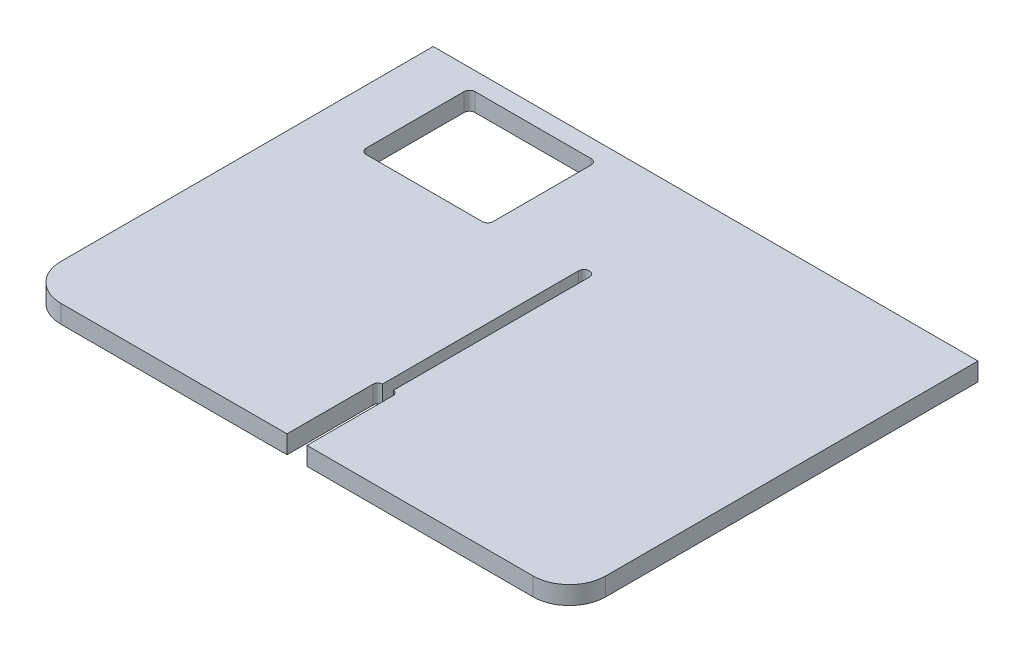
ISO-10303-21;
HEADER;
FILE_DESCRIPTION(('STEP AP214'),'2;1');
FILE_NAME('part.step','',(''),(''),'','','');
FILE_SCHEMA(('AUTOMOTIVE_DESIGN { 1 0 10303 214 1 1 1 1 }'));
ENDSEC;
DATA;
#1=APPLICATION_CONTEXT('core data for automotive mechanical design processes');
#2=APPLICATION_PROTOCOL_DEFINITION('international standard','automotive_design',2000,#1);
#3=PRODUCT_CONTEXT('',#1,'mechanical');
#4=PRODUCT('Part','Part','',(#3));
#5=PRODUCT_RELATED_PRODUCT_CATEGORY('part','',(#4));
#6=PRODUCT_DEFINITION_FORMATION('','',#4);
#7=PRODUCT_DEFINITION_CONTEXT('part definition',#1,'design');
#8=PRODUCT_DEFINITION('design','',#6,#7);
#9=PRODUCT_DEFINITION_SHAPE('','',#8);
#10=(LENGTH_UNIT() NAMED_UNIT(*) SI_UNIT(.MILLI.,.METRE.));
#11=(NAMED_UNIT(*) PLANE_ANGLE_UNIT() SI_UNIT($,.RADIAN.));
#12=(NAMED_UNIT(*) SI_UNIT($,.STERADIAN.) SOLID_ANGLE_UNIT());
#13=UNCERTAINTY_MEASURE_WITH_UNIT(LENGTH_MEASURE(1.E-05),#10,'distance_accuracy_value','');
#14=(GEOMETRIC_REPRESENTATION_CONTEXT(3) GLOBAL_UNCERTAINTY_ASSIGNED_CONTEXT((#13)) GLOBAL_UNIT_ASSIGNED_CONTEXT((#10,
#11,#12)) REPRESENTATION_CONTEXT('',''));
#15=CARTESIAN_POINT('',(0.,0.,0.));
#16=DIRECTION('',(0.,0.,1.));
#17=DIRECTION('',(1.,0.,0.));
#18=AXIS2_PLACEMENT_3D('',#15,#16,#17);
#19=CARTESIAN_POINT('',(0.,10.,75.));
#20=DIRECTION('',(0.,0.,-1.));
#21=DIRECTION('',(-1.,0.,0.));
#22=AXIS2_PLACEMENT_3D('',#19,#20,#21);
#23=PLANE('',#22);
#24=DIRECTION('',(1.,0.,0.));
#25=VECTOR('',#24,1.);
#26=CARTESIAN_POINT('',(0.,0.,75.));
#27=LINE('',#26,#25);
#28=CARTESIAN_POINT('',(-130.,0.,75.));
#29=VERTEX_POINT('',#28);
#30=CARTESIAN_POINT('',(-5.52414962358277,0.,75.));
#31=VERTEX_POINT('',#30);
#32=EDGE_CURVE('E287',#29,#31,#27,.T.);
#33=ORIENTED_EDGE('',*,*,#32,.T.);
#34=DIRECTION('',(0.,-1.,0.));
#35=VECTOR('',#34,1.);
#36=CARTESIAN_POINT('',(-5.52414962358277,10.,75.));
#37=LINE('',#36,#35);
#38=CARTESIAN_POINT('',(-5.52414962358277,10.,75.));
#39=VERTEX_POINT('',#38);
#40=EDGE_CURVE('E237',#39,#31,#37,.T.);
#41=ORIENTED_EDGE('',*,*,#40,.F.);
#42=DIRECTION('',(1.,0.,0.));
#43=VECTOR('',#42,1.);
#44=CARTESIAN_POINT('',(0.,10.,75.));
#45=LINE('',#44,#43);
#46=CARTESIAN_POINT('',(-130.,10.,75.));
#47=VERTEX_POINT('',#46);
#48=EDGE_CURVE('E278',#47,#39,#45,.T.);
#49=ORIENTED_EDGE('',*,*,#48,.F.);
#50=DIRECTION('',(0.,-1.,0.));
#51=VECTOR('',#50,1.);
#52=CARTESIAN_POINT('',(-130.,0.,75.));
#53=LINE('',#52,#51);
#54=EDGE_CURVE('E308',#47,#29,#53,.T.);
#55=ORIENTED_EDGE('',*,*,#54,.T.);
#56=EDGE_LOOP('',(#33,#41,#49,#55));
#57=FACE_BOUND('',#56,.T.);
#58=ADVANCED_FACE('F31',(#57),#23,.F.);
#59=CARTESIAN_POINT('',(0.,10.,-150.));
#60=DIRECTION('',(0.,1.,0.));
#61=DIRECTION('',(0.,0.,1.));
#62=AXIS2_PLACEMENT_3D('',#59,#60,#61);
#63=PLANE('',#62);
#64=DIRECTION('',(0.,0.,-1.));
#65=VECTOR('',#64,1.);
#66=CARTESIAN_POINT('',(-5.52414962358277,10.,27.5241496235828));
#67=LINE('',#66,#65);
#68=CARTESIAN_POINT('',(-5.52414962358277,10.,27.5241496235828));
#69=VERTEX_POINT('',#68);
#70=EDGE_CURVE('E193',#39,#69,#67,.T.);
#71=ORIENTED_EDGE('',*,*,#70,.T.);
#72=CARTESIAN_POINT('',(-2.99999999999999,10.,27.5241496235828));
#73=DIRECTION('',(0.,-1.,0.));
#74=DIRECTION('',(0.,0.,1.));
#75=AXIS2_PLACEMENT_3D('',#72,#73,#74);
#76=CIRCLE('',#75,2.52414962358278);
#77=CARTESIAN_POINT('',(-3.00000000000001,10.,25.));
#78=VERTEX_POINT('',#77);
#79=EDGE_CURVE('E185',#69,#78,#76,.T.);
#80=ORIENTED_EDGE('',*,*,#79,.T.);
#81=DIRECTION('',(0.,0.,-1.));
#82=VECTOR('',#81,1.);
#83=CARTESIAN_POINT('',(-3.00000000000001,10.,25.));
#84=LINE('',#83,#82);
#85=CARTESIAN_POINT('',(-2.99999999999999,10.,-83.));
#86=VERTEX_POINT('',#85);
#87=EDGE_CURVE('E196',#78,#86,#84,.T.);
#88=ORIENTED_EDGE('',*,*,#87,.T.);
#89=CARTESIAN_POINT('',(0.,10.,-83.));
#90=DIRECTION('',(0.,-1.,0.));
#91=DIRECTION('',(0.,0.,-1.));
#92=AXIS2_PLACEMENT_3D('',#89,#90,#91);
#93=CIRCLE('',#92,3.);
#94=CARTESIAN_POINT('',(3.00000000000001,10.,-83.));
#95=VERTEX_POINT('',#94);
#96=EDGE_CURVE('E201',#86,#95,#93,.T.);
#97=ORIENTED_EDGE('',*,*,#96,.T.);
#98=DIRECTION('',(0.,0.,1.));
#99=VECTOR('',#98,1.);
#100=CARTESIAN_POINT('',(2.99999999999999,10.,25.));
#101=LINE('',#100,#99);
#102=CARTESIAN_POINT('',(2.99999999999999,10.,25.));
#103=VERTEX_POINT('',#102);
#104=EDGE_CURVE('E211',#95,#103,#101,.T.);
#105=ORIENTED_EDGE('',*,*,#104,.T.);
#106=CARTESIAN_POINT('',(3.00000000000002,10.,27.4758503764172));
#107=DIRECTION('',(0.,-1.,0.));
#108=DIRECTION('',(0.,0.,1.));
#109=AXIS2_PLACEMENT_3D('',#106,#107,#108);
#110=CIRCLE('',#109,2.4758503764172);
#111=CARTESIAN_POINT('',(5.47585037641722,10.,27.4758503764172));
#112=VERTEX_POINT('',#111);
#113=EDGE_CURVE('E214',#103,#112,#110,.T.);
#114=ORIENTED_EDGE('',*,*,#113,.T.);
#115=DIRECTION('',(0.,0.,1.));
#116=VECTOR('',#115,1.);
#117=CARTESIAN_POINT('',(5.47585037641722,10.,27.4758503764172));
#118=LINE('',#117,#116);
#119=CARTESIAN_POINT('',(5.47585037641721,10.,75.));
#120=VERTEX_POINT('',#119);
#121=EDGE_CURVE('E217',#112,#120,#118,.T.);
#122=ORIENTED_EDGE('',*,*,#121,.T.);
#123=CARTESIAN_POINT('',(130.,10.,75.));
#124=VERTEX_POINT('',#123);
#125=EDGE_CURVE('E281',#120,#124,#45,.T.);
#126=ORIENTED_EDGE('',*,*,#125,.T.);
#127=CARTESIAN_POINT('',(130.,10.,55.));
#128=DIRECTION('',(0.,1.,0.));
#129=DIRECTION('',(0.,0.,1.));
#130=AXIS2_PLACEMENT_3D('',#127,#128,#129);
#131=CIRCLE('',#130,20.);
#132=CARTESIAN_POINT('',(150.,10.,55.));
#133=VERTEX_POINT('',#132);
#134=EDGE_CURVE('E306',#124,#133,#131,.T.);
#135=ORIENTED_EDGE('',*,*,#134,.T.);
#136=DIRECTION('',(0.,0.,-1.));
#137=VECTOR('',#136,1.);
#138=CARTESIAN_POINT('',(150.,10.,75.));
#139=LINE('',#138,#137);
#140=CARTESIAN_POINT('',(150.,10.,-150.));
#141=VERTEX_POINT('',#140);
#142=EDGE_CURVE('E280',#133,#141,#139,.T.);
#143=ORIENTED_EDGE('',*,*,#142,.T.);
#144=DIRECTION('',(-1.,0.,0.));
#145=VECTOR('',#144,1.);
#146=CARTESIAN_POINT('',(150.,10.,-150.));
#147=LINE('',#146,#145);
#148=CARTESIAN_POINT('',(-150.,10.,-150.));
#149=VERTEX_POINT('',#148);
#150=EDGE_CURVE('E283',#141,#149,#147,.T.);
#151=ORIENTED_EDGE('',*,*,#150,.T.);
#152=DIRECTION('',(0.,0.,-1.));
#153=VECTOR('',#152,1.);
#154=CARTESIAN_POINT('',(-150.,10.,-75.));
#155=LINE('',#154,#153);
#156=CARTESIAN_POINT('',(-150.,10.,55.));
#157=VERTEX_POINT('',#156);
#158=EDGE_CURVE('E271',#157,#149,#155,.T.);
#159=ORIENTED_EDGE('',*,*,#158,.F.);
#160=CARTESIAN_POINT('',(-130.,10.,55.));
#161=DIRECTION('',(0.,1.,0.));
#162=DIRECTION('',(0.,0.,1.));
#163=AXIS2_PLACEMENT_3D('',#160,#161,#162);
#164=CIRCLE('',#163,20.);
#165=EDGE_CURVE('E315',#157,#47,#164,.T.);
#166=ORIENTED_EDGE('',*,*,#165,.T.);
#167=ORIENTED_EDGE('',*,*,#48,.T.);
#168=EDGE_LOOP('',(#71,#80,#88,#97,#105,#114,#122,#126,#135,#143,#151,#159,#166,#167));
#169=FACE_BOUND('',#168,.T.);
#170=DIRECTION('',(1.,0.,0.));
#171=VECTOR('',#170,1.);
#172=CARTESIAN_POINT('',(-120.,10.,-80.));
#173=LINE('',#172,#171);
#174=CARTESIAN_POINT('',(-117.,10.,-80.));
#175=VERTEX_POINT('',#174);
#176=CARTESIAN_POINT('',(-53.,10.,-80.));
#177=VERTEX_POINT('',#176);
#178=EDGE_CURVE('E251',#175,#177,#173,.T.);
#179=ORIENTED_EDGE('',*,*,#178,.F.);
#180=CARTESIAN_POINT('',(-117.,10.,-83.));
#181=DIRECTION('',(0.,1.,0.));
#182=DIRECTION('',(0.,0.,1.));
#183=AXIS2_PLACEMENT_3D('',#180,#181,#182);
#184=CIRCLE('',#183,3.);
#185=CARTESIAN_POINT('',(-120.,10.,-83.));
#186=VERTEX_POINT('',#185);
#187=EDGE_CURVE('E339',#175,#186,#184,.F.);
#188=ORIENTED_EDGE('',*,*,#187,.T.);
#189=DIRECTION('',(0.,0.,1.));
#190=VECTOR('',#189,1.);
#191=CARTESIAN_POINT('',(-120.,10.,-140.));
#192=LINE('',#191,#190);
#193=CARTESIAN_POINT('',(-120.,10.,-137.));
#194=VERTEX_POINT('',#193);
#195=EDGE_CURVE('E248',#194,#186,#192,.T.);
#196=ORIENTED_EDGE('',*,*,#195,.F.);
#197=CARTESIAN_POINT('',(-117.,10.,-137.));
#198=DIRECTION('',(0.,1.,0.));
#199=DIRECTION('',(0.,0.,1.));
#200=AXIS2_PLACEMENT_3D('',#197,#198,#199);
#201=CIRCLE('',#200,3.);
#202=CARTESIAN_POINT('',(-117.,10.,-140.));
#203=VERTEX_POINT('',#202);
#204=EDGE_CURVE('E54',#194,#203,#201,.F.);
#205=ORIENTED_EDGE('',*,*,#204,.T.);
#206=DIRECTION('',(-1.,0.,0.));
#207=VECTOR('',#206,1.);
#208=CARTESIAN_POINT('',(-120.,10.,-140.));
#209=LINE('',#208,#207);
#210=CARTESIAN_POINT('',(-53.,10.,-140.));
#211=VERTEX_POINT('',#210);
#212=EDGE_CURVE('E258',#211,#203,#209,.T.);
#213=ORIENTED_EDGE('',*,*,#212,.F.);
#214=CARTESIAN_POINT('',(-53.,10.,-137.));
#215=DIRECTION('',(0.,1.,0.));
#216=DIRECTION('',(0.,0.,1.));
#217=AXIS2_PLACEMENT_3D('',#214,#215,#216);
#218=CIRCLE('',#217,3.);
#219=CARTESIAN_POINT('',(-50.,10.,-137.));
#220=VERTEX_POINT('',#219);
#221=EDGE_CURVE('E11',#211,#220,#218,.F.);
#222=ORIENTED_EDGE('',*,*,#221,.T.);
#223=DIRECTION('',(0.,0.,-1.));
#224=VECTOR('',#223,1.);
#225=CARTESIAN_POINT('',(-50.,10.,-140.));
#226=LINE('',#225,#224);
#227=CARTESIAN_POINT('',(-50.,10.,-83.));
#228=VERTEX_POINT('',#227);
#229=EDGE_CURVE('E255',#228,#220,#226,.T.);
#230=ORIENTED_EDGE('',*,*,#229,.F.);
#231=CARTESIAN_POINT('',(-53.,10.,-83.));
#232=DIRECTION('',(0.,1.,0.));
#233=DIRECTION('',(0.,0.,1.));
#234=AXIS2_PLACEMENT_3D('',#231,#232,#233);
#235=CIRCLE('',#234,3.);
#236=EDGE_CURVE('E343',#228,#177,#235,.F.);
#237=ORIENTED_EDGE('',*,*,#236,.T.);
#238=EDGE_LOOP('',(#179,#188,#196,#205,#213,#222,#230,#237));
#239=FACE_BOUND('',#238,.T.);
#240=ADVANCED_FACE('F203',(#169,#239),#63,.T.);
#241=CARTESIAN_POINT('',(0.,0.,-150.));
#242=DIRECTION('',(0.,1.,0.));
#243=DIRECTION('',(0.,0.,1.));
#244=AXIS2_PLACEMENT_3D('',#241,#242,#243);
#245=PLANE('',#244);
#246=CARTESIAN_POINT('',(-2.99999999999999,0.,27.5241496235828));
#247=DIRECTION('',(0.,-1.,0.));
#248=DIRECTION('',(0.,0.,1.));
#249=AXIS2_PLACEMENT_3D('',#246,#247,#248);
#250=CIRCLE('',#249,2.52414962358278);
#251=CARTESIAN_POINT('',(-5.52414962358277,0.,27.5241496235828));
#252=VERTEX_POINT('',#251);
#253=CARTESIAN_POINT('',(-3.00000000000001,0.,25.));
#254=VERTEX_POINT('',#253);
#255=EDGE_CURVE('E188',#252,#254,#250,.T.);
#256=ORIENTED_EDGE('',*,*,#255,.F.);
#257=DIRECTION('',(0.,0.,-1.));
#258=VECTOR('',#257,1.);
#259=CARTESIAN_POINT('',(-5.52414962358277,0.,27.5241496235828));
#260=LINE('',#259,#258);
#261=EDGE_CURVE('E205',#31,#252,#260,.T.);
#262=ORIENTED_EDGE('',*,*,#261,.F.);
#263=ORIENTED_EDGE('',*,*,#32,.F.);
#264=CARTESIAN_POINT('',(-130.,0.,55.));
#265=DIRECTION('',(0.,1.,0.));
#266=DIRECTION('',(0.,0.,1.));
#267=AXIS2_PLACEMENT_3D('',#264,#265,#266);
#268=CIRCLE('',#267,20.);
#269=CARTESIAN_POINT('',(-150.,0.,55.));
#270=VERTEX_POINT('',#269);
#271=EDGE_CURVE('E311',#29,#270,#268,.F.);
#272=ORIENTED_EDGE('',*,*,#271,.T.);
#273=DIRECTION('',(0.,0.,-1.));
#274=VECTOR('',#273,1.);
#275=CARTESIAN_POINT('',(-150.,0.,75.));
#276=LINE('',#275,#274);
#277=CARTESIAN_POINT('',(-150.,0.,-150.));
#278=VERTEX_POINT('',#277);
#279=EDGE_CURVE('E260',#270,#278,#276,.T.);
#280=ORIENTED_EDGE('',*,*,#279,.T.);
#281=DIRECTION('',(-1.,0.,0.));
#282=VECTOR('',#281,1.);
#283=CARTESIAN_POINT('',(150.,0.,-150.));
#284=LINE('',#283,#282);
#285=CARTESIAN_POINT('',(150.,0.,-150.));
#286=VERTEX_POINT('',#285);
#287=EDGE_CURVE('E292',#286,#278,#284,.T.);
#288=ORIENTED_EDGE('',*,*,#287,.F.);
#289=DIRECTION('',(0.,0.,-1.));
#290=VECTOR('',#289,1.);
#291=CARTESIAN_POINT('',(150.,0.,-75.));
#292=LINE('',#291,#290);
#293=CARTESIAN_POINT('',(150.,0.,55.));
#294=VERTEX_POINT('',#293);
#295=EDGE_CURVE('E290',#294,#286,#292,.T.);
#296=ORIENTED_EDGE('',*,*,#295,.F.);
#297=CARTESIAN_POINT('',(130.,0.,55.));
#298=DIRECTION('',(0.,1.,0.));
#299=DIRECTION('',(0.,0.,1.));
#300=AXIS2_PLACEMENT_3D('',#297,#298,#299);
#301=CIRCLE('',#300,20.);
#302=CARTESIAN_POINT('',(130.,0.,75.));
#303=VERTEX_POINT('',#302);
#304=EDGE_CURVE('E300',#294,#303,#301,.F.);
#305=ORIENTED_EDGE('',*,*,#304,.T.);
#306=CARTESIAN_POINT('',(5.47585037641722,0.,75.));
#307=VERTEX_POINT('',#306);
#308=EDGE_CURVE('E277',#307,#303,#27,.T.);
#309=ORIENTED_EDGE('',*,*,#308,.F.);
#310=DIRECTION('',(0.,0.,1.));
#311=VECTOR('',#310,1.);
#312=CARTESIAN_POINT('',(5.47585037641722,0.,27.4758503764172));
#313=LINE('',#312,#311);
#314=CARTESIAN_POINT('',(5.47585037641722,0.,27.4758503764172));
#315=VERTEX_POINT('',#314);
#316=EDGE_CURVE('E46',#315,#307,#313,.T.);
#317=ORIENTED_EDGE('',*,*,#316,.F.);
#318=CARTESIAN_POINT('',(3.00000000000002,0.,27.4758503764172));
#319=DIRECTION('',(0.,-1.,0.));
#320=DIRECTION('',(0.,0.,1.));
#321=AXIS2_PLACEMENT_3D('',#318,#319,#320);
#322=CIRCLE('',#321,2.4758503764172);
#323=CARTESIAN_POINT('',(2.99999999999999,0.,25.));
#324=VERTEX_POINT('',#323);
#325=EDGE_CURVE('E230',#324,#315,#322,.T.);
#326=ORIENTED_EDGE('',*,*,#325,.F.);
#327=DIRECTION('',(0.,0.,1.));
#328=VECTOR('',#327,1.);
#329=CARTESIAN_POINT('',(2.99999999999999,0.,25.));
#330=LINE('',#329,#328);
#331=CARTESIAN_POINT('',(3.00000000000001,0.,-83.));
#332=VERTEX_POINT('',#331);
#333=EDGE_CURVE('E227',#332,#324,#330,.T.);
#334=ORIENTED_EDGE('',*,*,#333,.F.);
#335=CARTESIAN_POINT('',(0.,0.,-83.));
#336=DIRECTION('',(0.,-1.,0.));
#337=DIRECTION('',(0.,0.,-1.));
#338=AXIS2_PLACEMENT_3D('',#335,#336,#337);
#339=CIRCLE('',#338,3.);
#340=CARTESIAN_POINT('',(-2.99999999999999,0.,-83.));
#341=VERTEX_POINT('',#340);
#342=EDGE_CURVE('E224',#341,#332,#339,.T.);
#343=ORIENTED_EDGE('',*,*,#342,.F.);
#344=DIRECTION('',(0.,0.,-1.));
#345=VECTOR('',#344,1.);
#346=CARTESIAN_POINT('',(-3.00000000000001,0.,25.));
#347=LINE('',#346,#345);
#348=EDGE_CURVE('E222',#254,#341,#347,.T.);
#349=ORIENTED_EDGE('',*,*,#348,.F.);
#350=EDGE_LOOP('',(#256,#262,#263,#272,#280,#288,#296,#305,#309,#317,#326,#334,#343,#349));
#351=FACE_BOUND('',#350,.T.);
#352=DIRECTION('',(-1.,0.,0.));
#353=VECTOR('',#352,1.);
#354=CARTESIAN_POINT('',(-120.,0.,-140.));
#355=LINE('',#354,#353);
#356=CARTESIAN_POINT('',(-53.,0.,-140.));
#357=VERTEX_POINT('',#356);
#358=CARTESIAN_POINT('',(-117.,0.,-140.));
#359=VERTEX_POINT('',#358);
#360=EDGE_CURVE('E252',#357,#359,#355,.T.);
#361=ORIENTED_EDGE('',*,*,#360,.T.);
#362=CARTESIAN_POINT('',(-117.,0.,-137.));
#363=DIRECTION('',(0.,1.,0.));
#364=DIRECTION('',(0.,0.,1.));
#365=AXIS2_PLACEMENT_3D('',#362,#363,#364);
#366=CIRCLE('',#365,3.);
#367=CARTESIAN_POINT('',(-120.,0.,-137.));
#368=VERTEX_POINT('',#367);
#369=EDGE_CURVE('E345',#359,#368,#366,.T.);
#370=ORIENTED_EDGE('',*,*,#369,.T.);
#371=DIRECTION('',(0.,0.,1.));
#372=VECTOR('',#371,1.);
#373=CARTESIAN_POINT('',(-120.,0.,-140.));
#374=LINE('',#373,#372);
#375=CARTESIAN_POINT('',(-120.,0.,-83.));
#376=VERTEX_POINT('',#375);
#377=EDGE_CURVE('E236',#368,#376,#374,.T.);
#378=ORIENTED_EDGE('',*,*,#377,.T.);
#379=CARTESIAN_POINT('',(-117.,0.,-83.));
#380=DIRECTION('',(0.,1.,0.));
#381=DIRECTION('',(0.,0.,1.));
#382=AXIS2_PLACEMENT_3D('',#379,#380,#381);
#383=CIRCLE('',#382,3.);
#384=CARTESIAN_POINT('',(-117.,0.,-80.));
#385=VERTEX_POINT('',#384);
#386=EDGE_CURVE('E337',#376,#385,#383,.T.);
#387=ORIENTED_EDGE('',*,*,#386,.T.);
#388=DIRECTION('',(1.,0.,0.));
#389=VECTOR('',#388,1.);
#390=CARTESIAN_POINT('',(-120.,0.,-80.));
#391=LINE('',#390,#389);
#392=CARTESIAN_POINT('',(-53.,0.,-80.));
#393=VERTEX_POINT('',#392);
#394=EDGE_CURVE('E263',#385,#393,#391,.T.);
#395=ORIENTED_EDGE('',*,*,#394,.T.);
#396=CARTESIAN_POINT('',(-53.,0.,-83.));
#397=DIRECTION('',(0.,1.,0.));
#398=DIRECTION('',(0.,0.,1.));
#399=AXIS2_PLACEMENT_3D('',#396,#397,#398);
#400=CIRCLE('',#399,3.);
#401=CARTESIAN_POINT('',(-50.,0.,-83.));
#402=VERTEX_POINT('',#401);
#403=EDGE_CURVE('E341',#393,#402,#400,.T.);
#404=ORIENTED_EDGE('',*,*,#403,.T.);
#405=DIRECTION('',(0.,0.,-1.));
#406=VECTOR('',#405,1.);
#407=CARTESIAN_POINT('',(-50.,0.,-140.));
#408=LINE('',#407,#406);
#409=CARTESIAN_POINT('',(-50.,0.,-137.));
#410=VERTEX_POINT('',#409);
#411=EDGE_CURVE('E266',#402,#410,#408,.T.);
#412=ORIENTED_EDGE('',*,*,#411,.T.);
#413=CARTESIAN_POINT('',(-53.,0.,-137.));
#414=DIRECTION('',(0.,1.,0.));
#415=DIRECTION('',(0.,0.,1.));
#416=AXIS2_PLACEMENT_3D('',#413,#414,#415);
#417=CIRCLE('',#416,3.);
#418=EDGE_CURVE('E39',#410,#357,#417,.T.);
#419=ORIENTED_EDGE('',*,*,#418,.T.);
#420=EDGE_LOOP('',(#361,#370,#378,#387,#395,#404,#412,#419));
#421=FACE_BOUND('',#420,.T.);
#422=ADVANCED_FACE('F349',(#351,#421),#245,.F.);
#423=ORIENTED_EDGE('',*,*,#125,.F.);
#424=DIRECTION('',(0.,-1.,0.));
#425=VECTOR('',#424,1.);
#426=CARTESIAN_POINT('',(5.47585037641721,10.,75.));
#427=LINE('',#426,#425);
#428=EDGE_CURVE('E239',#120,#307,#427,.T.);
#429=ORIENTED_EDGE('',*,*,#428,.T.);
#430=ORIENTED_EDGE('',*,*,#308,.T.);
#431=DIRECTION('',(0.,-1.,0.));
#432=VECTOR('',#431,1.);
#433=CARTESIAN_POINT('',(130.,10.,75.));
#434=LINE('',#433,#432);
#435=EDGE_CURVE('E303',#303,#124,#434,.F.);
#436=ORIENTED_EDGE('',*,*,#435,.T.);
#437=EDGE_LOOP('',(#423,#429,#430,#436));
#438=FACE_BOUND('',#437,.T.);
#439=ADVANCED_FACE('F390',(#438),#23,.F.);
#440=CARTESIAN_POINT('',(150.,10.,-75.));
#441=DIRECTION('',(-1.,0.,0.));
#442=DIRECTION('',(0.,0.,1.));
#443=AXIS2_PLACEMENT_3D('',#440,#441,#442);
#444=PLANE('',#443);
#445=ORIENTED_EDGE('',*,*,#142,.F.);
#446=DIRECTION('',(0.,-1.,0.));
#447=VECTOR('',#446,1.);
#448=CARTESIAN_POINT('',(150.,10.,55.));
#449=LINE('',#448,#447);
#450=EDGE_CURVE('E297',#133,#294,#449,.T.);
#451=ORIENTED_EDGE('',*,*,#450,.T.);
#452=ORIENTED_EDGE('',*,*,#295,.T.);
#453=DIRECTION('',(0.,-1.,0.));
#454=VECTOR('',#453,1.);
#455=CARTESIAN_POINT('',(150.,10.,-150.));
#456=LINE('',#455,#454);
#457=EDGE_CURVE('E286',#141,#286,#456,.T.);
#458=ORIENTED_EDGE('',*,*,#457,.F.);
#459=EDGE_LOOP('',(#445,#451,#452,#458));
#460=FACE_BOUND('',#459,.T.);
#461=ADVANCED_FACE('F399',(#460),#444,.F.);
#462=CARTESIAN_POINT('',(150.,10.,-150.));
#463=DIRECTION('',(0.,0.,1.));
#464=DIRECTION('',(1.,0.,0.));
#465=AXIS2_PLACEMENT_3D('',#462,#463,#464);
#466=PLANE('',#465);
#467=ORIENTED_EDGE('',*,*,#287,.T.);
#468=DIRECTION('',(0.,-1.,0.));
#469=VECTOR('',#468,1.);
#470=CARTESIAN_POINT('',(-150.,10.,-150.));
#471=LINE('',#470,#469);
#472=EDGE_CURVE('E273',#149,#278,#471,.T.);
#473=ORIENTED_EDGE('',*,*,#472,.F.);
#474=ORIENTED_EDGE('',*,*,#150,.F.);
#475=ORIENTED_EDGE('',*,*,#457,.T.);
#476=EDGE_LOOP('',(#467,#473,#474,#475));
#477=FACE_BOUND('',#476,.T.);
#478=ADVANCED_FACE('F406',(#477),#466,.F.);
#479=CARTESIAN_POINT('',(130.,10.,55.));
#480=DIRECTION('',(0.,-1.,0.));
#481=DIRECTION('',(0.,0.,-1.));
#482=AXIS2_PLACEMENT_3D('',#479,#480,#481);
#483=CYLINDRICAL_SURFACE('',#482,20.);
#484=ORIENTED_EDGE('',*,*,#134,.F.);
#485=ORIENTED_EDGE('',*,*,#435,.F.);
#486=ORIENTED_EDGE('',*,*,#304,.F.);
#487=ORIENTED_EDGE('',*,*,#450,.F.);
#488=EDGE_LOOP('',(#484,#485,#486,#487));
#489=FACE_BOUND('',#488,.T.);
#490=ADVANCED_FACE('F426',(#489),#483,.T.);
#491=CARTESIAN_POINT('',(-150.,10.,75.));
#492=DIRECTION('',(-1.,0.,0.));
#493=DIRECTION('',(0.,0.,1.));
#494=AXIS2_PLACEMENT_3D('',#491,#492,#493);
#495=PLANE('',#494);
#496=ORIENTED_EDGE('',*,*,#279,.F.);
#497=DIRECTION('',(0.,-1.,0.));
#498=VECTOR('',#497,1.);
#499=CARTESIAN_POINT('',(-150.,10.,55.));
#500=LINE('',#499,#498);
#501=EDGE_CURVE('E313',#270,#157,#500,.F.);
#502=ORIENTED_EDGE('',*,*,#501,.T.);
#503=ORIENTED_EDGE('',*,*,#158,.T.);
#504=ORIENTED_EDGE('',*,*,#472,.T.);
#505=EDGE_LOOP('',(#496,#502,#503,#504));
#506=FACE_BOUND('',#505,.T.);
#507=ADVANCED_FACE('F435',(#506),#495,.T.);
#508=CARTESIAN_POINT('',(-130.,10.,55.));
#509=DIRECTION('',(0.,1.,0.));
#510=DIRECTION('',(0.,0.,1.));
#511=AXIS2_PLACEMENT_3D('',#508,#509,#510);
#512=CYLINDRICAL_SURFACE('',#511,20.);
#513=ORIENTED_EDGE('',*,*,#165,.F.);
#514=ORIENTED_EDGE('',*,*,#501,.F.);
#515=ORIENTED_EDGE('',*,*,#271,.F.);
#516=ORIENTED_EDGE('',*,*,#54,.F.);
#517=EDGE_LOOP('',(#513,#514,#515,#516));
#518=FACE_BOUND('',#517,.T.);
#519=ADVANCED_FACE('F438',(#518),#512,.T.);
#520=CARTESIAN_POINT('',(-120.,10.,-140.));
#521=DIRECTION('',(1.,0.,0.));
#522=DIRECTION('',(0.,0.,-1.));
#523=AXIS2_PLACEMENT_3D('',#520,#521,#522);
#524=PLANE('',#523);
#525=ORIENTED_EDGE('',*,*,#195,.T.);
#526=DIRECTION('',(0.,-1.,0.));
#527=VECTOR('',#526,1.);
#528=CARTESIAN_POINT('',(-120.,0.,-83.));
#529=LINE('',#528,#527);
#530=EDGE_CURVE('E319',#186,#376,#529,.T.);
#531=ORIENTED_EDGE('',*,*,#530,.T.);
#532=ORIENTED_EDGE('',*,*,#377,.F.);
#533=DIRECTION('',(0.,-1.,0.));
#534=VECTOR('',#533,1.);
#535=CARTESIAN_POINT('',(-120.,10.,-137.));
#536=LINE('',#535,#534);
#537=EDGE_CURVE('E317',#368,#194,#536,.F.);
#538=ORIENTED_EDGE('',*,*,#537,.T.);
#539=EDGE_LOOP('',(#525,#531,#532,#538));
#540=FACE_BOUND('',#539,.T.);
#541=ADVANCED_FACE('F376',(#540),#524,.T.);
#542=CARTESIAN_POINT('',(-120.,10.,-80.));
#543=DIRECTION('',(0.,0.,-1.));
#544=DIRECTION('',(-1.,0.,0.));
#545=AXIS2_PLACEMENT_3D('',#542,#543,#544);
#546=PLANE('',#545);
#547=ORIENTED_EDGE('',*,*,#394,.F.);
#548=DIRECTION('',(0.,-1.,0.));
#549=VECTOR('',#548,1.);
#550=CARTESIAN_POINT('',(-117.,10.,-80.));
#551=LINE('',#550,#549);
#552=EDGE_CURVE('E325',#385,#175,#551,.F.);
#553=ORIENTED_EDGE('',*,*,#552,.T.);
#554=ORIENTED_EDGE('',*,*,#178,.T.);
#555=DIRECTION('',(0.,-1.,0.));
#556=VECTOR('',#555,1.);
#557=CARTESIAN_POINT('',(-53.,0.,-80.));
#558=LINE('',#557,#556);
#559=EDGE_CURVE('E322',#177,#393,#558,.T.);
#560=ORIENTED_EDGE('',*,*,#559,.T.);
#561=EDGE_LOOP('',(#547,#553,#554,#560));
#562=FACE_BOUND('',#561,.T.);
#563=ADVANCED_FACE('F370',(#562),#546,.T.);
#564=CARTESIAN_POINT('',(-50.,10.,-140.));
#565=DIRECTION('',(-1.,0.,0.));
#566=DIRECTION('',(0.,0.,1.));
#567=AXIS2_PLACEMENT_3D('',#564,#565,#566);
#568=PLANE('',#567);
#569=ORIENTED_EDGE('',*,*,#411,.F.);
#570=DIRECTION('',(0.,-1.,0.));
#571=VECTOR('',#570,1.);
#572=CARTESIAN_POINT('',(-50.,10.,-83.));
#573=LINE('',#572,#571);
#574=EDGE_CURVE('E330',#402,#228,#573,.F.);
#575=ORIENTED_EDGE('',*,*,#574,.T.);
#576=ORIENTED_EDGE('',*,*,#229,.T.);
#577=DIRECTION('',(0.,-1.,0.));
#578=VECTOR('',#577,1.);
#579=CARTESIAN_POINT('',(-50.,0.,-137.));
#580=LINE('',#579,#578);
#581=EDGE_CURVE('E327',#220,#410,#580,.T.);
#582=ORIENTED_EDGE('',*,*,#581,.T.);
#583=EDGE_LOOP('',(#569,#575,#576,#582));
#584=FACE_BOUND('',#583,.T.);
#585=ADVANCED_FACE('F362',(#584),#568,.T.);
#586=CARTESIAN_POINT('',(-120.,10.,-140.));
#587=DIRECTION('',(0.,0.,1.));
#588=DIRECTION('',(1.,0.,0.));
#589=AXIS2_PLACEMENT_3D('',#586,#587,#588);
#590=PLANE('',#589);
#591=ORIENTED_EDGE('',*,*,#212,.T.);
#592=DIRECTION('',(0.,-1.,0.));
#593=VECTOR('',#592,1.);
#594=CARTESIAN_POINT('',(-117.,0.,-140.));
#595=LINE('',#594,#593);
#596=EDGE_CURVE('E334',#203,#359,#595,.T.);
#597=ORIENTED_EDGE('',*,*,#596,.T.);
#598=ORIENTED_EDGE('',*,*,#360,.F.);
#599=DIRECTION('',(0.,-1.,0.));
#600=VECTOR('',#599,1.);
#601=CARTESIAN_POINT('',(-53.,10.,-140.));
#602=LINE('',#601,#600);
#603=EDGE_CURVE('E332',#357,#211,#602,.F.);
#604=ORIENTED_EDGE('',*,*,#603,.T.);
#605=EDGE_LOOP('',(#591,#597,#598,#604));
#606=FACE_BOUND('',#605,.T.);
#607=ADVANCED_FACE('F355',(#606),#590,.T.);
#608=CARTESIAN_POINT('',(-117.,10.,-83.));
#609=DIRECTION('',(0.,1.,0.));
#610=DIRECTION('',(0.,0.,1.));
#611=AXIS2_PLACEMENT_3D('',#608,#609,#610);
#612=CYLINDRICAL_SURFACE('',#611,3.);
#613=ORIENTED_EDGE('',*,*,#187,.F.);
#614=ORIENTED_EDGE('',*,*,#552,.F.);
#615=ORIENTED_EDGE('',*,*,#386,.F.);
#616=ORIENTED_EDGE('',*,*,#530,.F.);
#617=EDGE_LOOP('',(#613,#614,#615,#616));
#618=FACE_BOUND('',#617,.T.);
#619=ADVANCED_FACE('F373',(#618),#612,.F.);
#620=CARTESIAN_POINT('',(-53.,10.,-83.));
#621=DIRECTION('',(0.,1.,0.));
#622=DIRECTION('',(0.,0.,1.));
#623=AXIS2_PLACEMENT_3D('',#620,#621,#622);
#624=CYLINDRICAL_SURFACE('',#623,3.);
#625=ORIENTED_EDGE('',*,*,#236,.F.);
#626=ORIENTED_EDGE('',*,*,#574,.F.);
#627=ORIENTED_EDGE('',*,*,#403,.F.);
#628=ORIENTED_EDGE('',*,*,#559,.F.);
#629=EDGE_LOOP('',(#625,#626,#627,#628));
#630=FACE_BOUND('',#629,.T.);
#631=ADVANCED_FACE('F365',(#630),#624,.F.);
#632=CARTESIAN_POINT('',(-117.,10.,-137.));
#633=DIRECTION('',(0.,1.,0.));
#634=DIRECTION('',(0.,0.,1.));
#635=AXIS2_PLACEMENT_3D('',#632,#633,#634);
#636=CYLINDRICAL_SURFACE('',#635,3.);
#637=ORIENTED_EDGE('',*,*,#204,.F.);
#638=ORIENTED_EDGE('',*,*,#537,.F.);
#639=ORIENTED_EDGE('',*,*,#369,.F.);
#640=ORIENTED_EDGE('',*,*,#596,.F.);
#641=EDGE_LOOP('',(#637,#638,#639,#640));
#642=FACE_BOUND('',#641,.T.);
#643=ADVANCED_FACE('F380',(#642),#636,.F.);
#644=CARTESIAN_POINT('',(-53.,10.,-137.));
#645=DIRECTION('',(0.,1.,0.));
#646=DIRECTION('',(0.,0.,1.));
#647=AXIS2_PLACEMENT_3D('',#644,#645,#646);
#648=CYLINDRICAL_SURFACE('',#647,3.);
#649=ORIENTED_EDGE('',*,*,#221,.F.);
#650=ORIENTED_EDGE('',*,*,#603,.F.);
#651=ORIENTED_EDGE('',*,*,#418,.F.);
#652=ORIENTED_EDGE('',*,*,#581,.F.);
#653=EDGE_LOOP('',(#649,#650,#651,#652));
#654=FACE_BOUND('',#653,.T.);
#655=ADVANCED_FACE('F33',(#654),#648,.F.);
#656=CARTESIAN_POINT('',(-2.99999999999999,10.,27.5241496235828));
#657=DIRECTION('',(0.,-1.,0.));
#658=DIRECTION('',(0.,0.,-1.));
#659=AXIS2_PLACEMENT_3D('',#656,#657,#658);
#660=CYLINDRICAL_SURFACE('',#659,2.52414962358278);
#661=ORIENTED_EDGE('',*,*,#255,.T.);
#662=DIRECTION('',(0.,-1.,0.));
#663=VECTOR('',#662,1.);
#664=CARTESIAN_POINT('',(-3.00000000000001,10.,25.));
#665=LINE('',#664,#663);
#666=EDGE_CURVE('E181',#78,#254,#665,.T.);
#667=ORIENTED_EDGE('',*,*,#666,.F.);
#668=ORIENTED_EDGE('',*,*,#79,.F.);
#669=DIRECTION('',(0.,-1.,0.));
#670=VECTOR('',#669,1.);
#671=CARTESIAN_POINT('',(-5.52414962358277,10.,27.5241496235828));
#672=LINE('',#671,#670);
#673=EDGE_CURVE('E234',#69,#252,#672,.T.);
#674=ORIENTED_EDGE('',*,*,#673,.T.);
#675=EDGE_LOOP('',(#661,#667,#668,#674));
#676=FACE_BOUND('',#675,.T.);
#677=ADVANCED_FACE('F183',(#676),#660,.F.);
#678=CARTESIAN_POINT('',(-5.52414962358277,10.,27.5241496235828));
#679=DIRECTION('',(-1.,0.,0.));
#680=DIRECTION('',(0.,0.,1.));
#681=AXIS2_PLACEMENT_3D('',#678,#679,#680);
#682=PLANE('',#681);
#683=ORIENTED_EDGE('',*,*,#261,.T.);
#684=ORIENTED_EDGE('',*,*,#673,.F.);
#685=ORIENTED_EDGE('',*,*,#70,.F.);
#686=ORIENTED_EDGE('',*,*,#40,.T.);
#687=EDGE_LOOP('',(#683,#684,#685,#686));
#688=FACE_BOUND('',#687,.T.);
#689=ADVANCED_FACE('F445',(#688),#682,.F.);
#690=CARTESIAN_POINT('',(5.47585037641722,10.,27.4758503764172));
#691=DIRECTION('',(1.,0.,0.));
#692=DIRECTION('',(0.,0.,-1.));
#693=AXIS2_PLACEMENT_3D('',#690,#691,#692);
#694=PLANE('',#693);
#695=ORIENTED_EDGE('',*,*,#316,.T.);
#696=ORIENTED_EDGE('',*,*,#428,.F.);
#697=ORIENTED_EDGE('',*,*,#121,.F.);
#698=DIRECTION('',(0.,-1.,0.));
#699=VECTOR('',#698,1.);
#700=CARTESIAN_POINT('',(5.47585037641722,10.,27.4758503764172));
#701=LINE('',#700,#699);
#702=EDGE_CURVE('E241',#112,#315,#701,.T.);
#703=ORIENTED_EDGE('',*,*,#702,.T.);
#704=EDGE_LOOP('',(#695,#696,#697,#703));
#705=FACE_BOUND('',#704,.T.);
#706=ADVANCED_FACE('F417',(#705),#694,.F.);
#707=CARTESIAN_POINT('',(3.00000000000002,10.,27.4758503764172));
#708=DIRECTION('',(0.,-1.,0.));
#709=DIRECTION('',(0.,0.,-1.));
#710=AXIS2_PLACEMENT_3D('',#707,#708,#709);
#711=CYLINDRICAL_SURFACE('',#710,2.4758503764172);
#712=ORIENTED_EDGE('',*,*,#325,.T.);
#713=ORIENTED_EDGE('',*,*,#702,.F.);
#714=ORIENTED_EDGE('',*,*,#113,.F.);
#715=DIRECTION('',(0.,-1.,0.));
#716=VECTOR('',#715,1.);
#717=CARTESIAN_POINT('',(2.99999999999999,10.,25.));
#718=LINE('',#717,#716);
#719=EDGE_CURVE('E243',#103,#324,#718,.T.);
#720=ORIENTED_EDGE('',*,*,#719,.T.);
#721=EDGE_LOOP('',(#712,#713,#714,#720));
#722=FACE_BOUND('',#721,.T.);
#723=ADVANCED_FACE('F420',(#722),#711,.F.);
#724=CARTESIAN_POINT('',(2.99999999999999,10.,25.));
#725=DIRECTION('',(1.,0.,0.));
#726=DIRECTION('',(0.,0.,-1.));
#727=AXIS2_PLACEMENT_3D('',#724,#725,#726);
#728=PLANE('',#727);
#729=ORIENTED_EDGE('',*,*,#333,.T.);
#730=ORIENTED_EDGE('',*,*,#719,.F.);
#731=ORIENTED_EDGE('',*,*,#104,.F.);
#732=DIRECTION('',(0.,-1.,0.));
#733=VECTOR('',#732,1.);
#734=CARTESIAN_POINT('',(3.00000000000001,10.,-83.));
#735=LINE('',#734,#733);
#736=EDGE_CURVE('E245',#95,#332,#735,.T.);
#737=ORIENTED_EDGE('',*,*,#736,.T.);
#738=EDGE_LOOP('',(#729,#730,#731,#737));
#739=FACE_BOUND('',#738,.T.);
#740=ADVANCED_FACE('F451',(#739),#728,.F.);
#741=CARTESIAN_POINT('',(0.,10.,-83.));
#742=DIRECTION('',(0.,-1.,0.));
#743=DIRECTION('',(0.,0.,-1.));
#744=AXIS2_PLACEMENT_3D('',#741,#742,#743);
#745=CYLINDRICAL_SURFACE('',#744,3.);
#746=ORIENTED_EDGE('',*,*,#342,.T.);
#747=ORIENTED_EDGE('',*,*,#736,.F.);
#748=ORIENTED_EDGE('',*,*,#96,.F.);
#749=DIRECTION('',(0.,-1.,0.));
#750=VECTOR('',#749,1.);
#751=CARTESIAN_POINT('',(-2.99999999999999,10.,-83.));
#752=LINE('',#751,#750);
#753=EDGE_CURVE('E192',#86,#341,#752,.T.);
#754=ORIENTED_EDGE('',*,*,#753,.T.);
#755=EDGE_LOOP('',(#746,#747,#748,#754));
#756=FACE_BOUND('',#755,.T.);
#757=ADVANCED_FACE('F448',(#756),#745,.F.);
#758=CARTESIAN_POINT('',(-3.00000000000001,10.,25.));
#759=DIRECTION('',(-1.,0.,0.));
#760=DIRECTION('',(0.,0.,1.));
#761=AXIS2_PLACEMENT_3D('',#758,#759,#760);
#762=PLANE('',#761);
#763=ORIENTED_EDGE('',*,*,#348,.T.);
#764=ORIENTED_EDGE('',*,*,#753,.F.);
#765=ORIENTED_EDGE('',*,*,#87,.F.);
#766=ORIENTED_EDGE('',*,*,#666,.T.);
#767=EDGE_LOOP('',(#763,#764,#765,#766));
#768=FACE_BOUND('',#767,.T.);
#769=ADVANCED_FACE('F197',(#768),#762,.F.);
#770=CLOSED_SHELL('',(#58,#240,#422,#439,#461,#478,#490,#507,#519,#541,#563,#585,#607,#619,#631,
#643,#655,#677,#689,#706,#723,#740,#757,#769));
#771=MANIFOLD_SOLID_BREP('B2',#770);
#772=ADVANCED_BREP_SHAPE_REPRESENTATION('',(#18,#771),#14);
#773=SHAPE_DEFINITION_REPRESENTATION(#9,#772);
ENDSEC;
END-ISO-10303-21;
